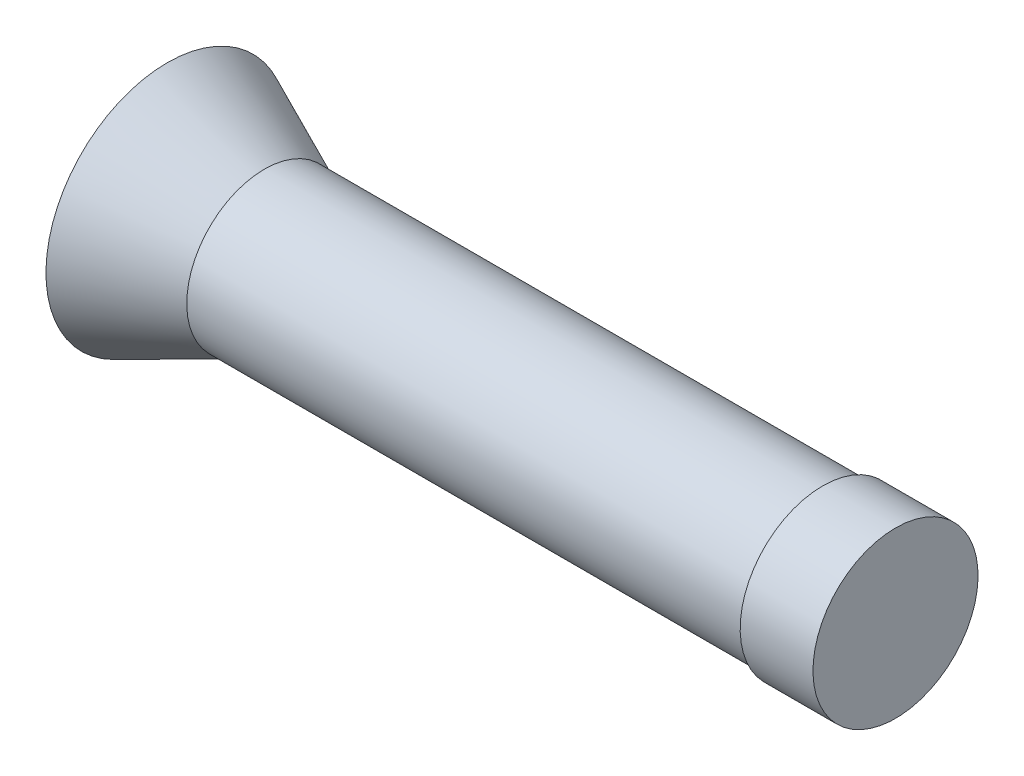
ISO-10303-21;
HEADER;
FILE_DESCRIPTION(('STEP AP214'),'2;1');
FILE_NAME('part.step','',(''),(''),'','','');
FILE_SCHEMA(('AUTOMOTIVE_DESIGN { 1 0 10303 214 1 1 1 1 }'));
ENDSEC;
DATA;
#1=APPLICATION_CONTEXT('core data for automotive mechanical design processes');
#2=APPLICATION_PROTOCOL_DEFINITION('international standard','automotive_design',2000,#1);
#3=PRODUCT_CONTEXT('',#1,'mechanical');
#4=PRODUCT('Part','Part','',(#3));
#5=PRODUCT_RELATED_PRODUCT_CATEGORY('part','',(#4));
#6=PRODUCT_DEFINITION_FORMATION('','',#4);
#7=PRODUCT_DEFINITION_CONTEXT('part definition',#1,'design');
#8=PRODUCT_DEFINITION('design','',#6,#7);
#9=PRODUCT_DEFINITION_SHAPE('','',#8);
#10=(LENGTH_UNIT() NAMED_UNIT(*) SI_UNIT(.MILLI.,.METRE.));
#11=(NAMED_UNIT(*) PLANE_ANGLE_UNIT() SI_UNIT($,.RADIAN.));
#12=(NAMED_UNIT(*) SI_UNIT($,.STERADIAN.) SOLID_ANGLE_UNIT());
#13=UNCERTAINTY_MEASURE_WITH_UNIT(LENGTH_MEASURE(1.E-05),#10,'distance_accuracy_value','');
#14=(GEOMETRIC_REPRESENTATION_CONTEXT(3) GLOBAL_UNCERTAINTY_ASSIGNED_CONTEXT((#13)) GLOBAL_UNIT_ASSIGNED_CONTEXT((#10,
#11,#12)) REPRESENTATION_CONTEXT('',''));
#15=CARTESIAN_POINT('',(0.,0.,0.));
#16=DIRECTION('',(0.,0.,1.));
#17=DIRECTION('',(1.,0.,0.));
#18=AXIS2_PLACEMENT_3D('',#15,#16,#17);
#19=CARTESIAN_POINT('',(0.,0.,0.));
#20=DIRECTION('',(-1.,0.,0.));
#21=DIRECTION('',(0.,-1.,0.));
#22=AXIS2_PLACEMENT_3D('',#19,#20,#21);
#23=PLANE('',#22);
#24=CARTESIAN_POINT('',(0.,-16.,0.));
#25=DIRECTION('',(1.,0.,0.));
#26=DIRECTION('',(0.,1.,0.));
#27=AXIS2_PLACEMENT_3D('',#24,#25,#26);
#28=CIRCLE('',#27,16.);
#29=CARTESIAN_POINT('',(0.,0.,0.));
#30=VERTEX_POINT('',#29);
#31=EDGE_CURVE('E51',#30,#30,#28,.T.);
#32=ORIENTED_EDGE('',*,*,#31,.T.);
#33=EDGE_LOOP('',(#32));
#34=FACE_BOUND('',#33,.T.);
#35=CARTESIAN_POINT('',(0.,-16.,0.));
#36=DIRECTION('',(1.,0.,0.));
#37=DIRECTION('',(0.,1.,0.));
#38=AXIS2_PLACEMENT_3D('',#35,#36,#37);
#39=CIRCLE('',#38,17.);
#40=CARTESIAN_POINT('',(0.,1.,0.));
#41=VERTEX_POINT('',#40);
#42=EDGE_CURVE('E10',#41,#41,#39,.T.);
#43=ORIENTED_EDGE('',*,*,#42,.F.);
#44=EDGE_LOOP('',(#43));
#45=FACE_BOUND('',#44,.T.);
#46=ADVANCED_FACE('F32',(#34,#45),#23,.T.);
#47=CARTESIAN_POINT('',(15.,-16.,0.));
#48=DIRECTION('',(1.,0.,0.));
#49=DIRECTION('',(0.,1.,0.));
#50=AXIS2_PLACEMENT_3D('',#47,#48,#49);
#51=CYLINDRICAL_SURFACE('',#50,17.);
#52=ORIENTED_EDGE('',*,*,#42,.T.);
#53=EDGE_LOOP('',(#52));
#54=FACE_BOUND('',#53,.T.);
#55=CARTESIAN_POINT('',(15.,-16.,0.));
#56=DIRECTION('',(1.,0.,0.));
#57=DIRECTION('',(0.,1.,0.));
#58=AXIS2_PLACEMENT_3D('',#55,#56,#57);
#59=CIRCLE('',#58,17.);
#60=CARTESIAN_POINT('',(15.,1.,0.));
#61=VERTEX_POINT('',#60);
#62=EDGE_CURVE('E38',#61,#61,#59,.T.);
#63=ORIENTED_EDGE('',*,*,#62,.F.);
#64=EDGE_LOOP('',(#63));
#65=FACE_BOUND('',#64,.T.);
#66=ADVANCED_FACE('F90',(#54,#65),#51,.T.);
#67=CARTESIAN_POINT('',(15.,1.,0.));
#68=DIRECTION('',(1.,0.,0.));
#69=DIRECTION('',(0.,1.,0.));
#70=AXIS2_PLACEMENT_3D('',#67,#68,#69);
#71=PLANE('',#70);
#72=ORIENTED_EDGE('',*,*,#62,.T.);
#73=EDGE_LOOP('',(#72));
#74=FACE_BOUND('',#73,.T.);
#75=ADVANCED_FACE('F74',(#74),#71,.T.);
#76=CARTESIAN_POINT('',(-135.,-16.,0.));
#77=DIRECTION('',(-1.,0.,0.));
#78=DIRECTION('',(0.,-1.,0.));
#79=AXIS2_PLACEMENT_3D('',#76,#77,#78);
#80=PLANE('',#79);
#81=CARTESIAN_POINT('',(-135.,-16.,0.));
#82=DIRECTION('',(-1.,0.,0.));
#83=DIRECTION('',(0.,-1.,0.));
#84=AXIS2_PLACEMENT_3D('',#81,#82,#83);
#85=CIRCLE('',#84,15.);
#86=CARTESIAN_POINT('',(-135.,-31.,0.));
#87=VERTEX_POINT('',#86);
#88=EDGE_CURVE('E55',#87,#87,#85,.T.);
#89=ORIENTED_EDGE('',*,*,#88,.F.);
#90=EDGE_LOOP('',(#89));
#91=FACE_BOUND('',#90,.T.);
#92=CARTESIAN_POINT('',(-135.,-16.,0.));
#93=DIRECTION('',(1.,0.,0.));
#94=DIRECTION('',(0.,1.,0.));
#95=AXIS2_PLACEMENT_3D('',#92,#93,#94);
#96=CIRCLE('',#95,25.);
#97=CARTESIAN_POINT('',(-135.,8.99999999999998,0.));
#98=VERTEX_POINT('',#97);
#99=EDGE_CURVE('E42',#98,#98,#96,.T.);
#100=ORIENTED_EDGE('',*,*,#99,.F.);
#101=EDGE_LOOP('',(#100));
#102=FACE_BOUND('',#101,.T.);
#103=ADVANCED_FACE('F70',(#91,#102),#80,.T.);
#104=CARTESIAN_POINT('',(-115.,-16.,0.));
#105=DIRECTION('',(-1.,0.,0.));
#106=DIRECTION('',(0.,-1.,0.));
#107=AXIS2_PLACEMENT_3D('',#104,#105,#106);
#108=CONICAL_SURFACE('',#107,16.,0.422853926132941);
#109=ORIENTED_EDGE('',*,*,#99,.T.);
#110=EDGE_LOOP('',(#109));
#111=FACE_BOUND('',#110,.T.);
#112=CARTESIAN_POINT('',(-115.,-16.,0.));
#113=DIRECTION('',(1.,0.,0.));
#114=DIRECTION('',(0.,1.,0.));
#115=AXIS2_PLACEMENT_3D('',#112,#113,#114);
#116=CIRCLE('',#115,16.);
#117=CARTESIAN_POINT('',(-115.,0.,0.));
#118=VERTEX_POINT('',#117);
#119=EDGE_CURVE('E46',#118,#118,#116,.T.);
#120=ORIENTED_EDGE('',*,*,#119,.F.);
#121=EDGE_LOOP('',(#120));
#122=FACE_BOUND('',#121,.T.);
#123=ADVANCED_FACE('F73',(#111,#122),#108,.T.);
#124=CARTESIAN_POINT('',(15.,-16.,0.));
#125=DIRECTION('',(1.,0.,0.));
#126=DIRECTION('',(0.,1.,0.));
#127=AXIS2_PLACEMENT_3D('',#124,#125,#126);
#128=CYLINDRICAL_SURFACE('',#127,16.);
#129=ORIENTED_EDGE('',*,*,#119,.T.);
#130=EDGE_LOOP('',(#129));
#131=FACE_BOUND('',#130,.T.);
#132=ORIENTED_EDGE('',*,*,#31,.F.);
#133=EDGE_LOOP('',(#132));
#134=FACE_BOUND('',#133,.T.);
#135=ADVANCED_FACE('F66',(#131,#134),#128,.T.);
#136=CARTESIAN_POINT('',(10.,-16.,0.));
#137=DIRECTION('',(-1.,0.,0.));
#138=DIRECTION('',(0.,-1.,0.));
#139=AXIS2_PLACEMENT_3D('',#136,#137,#138);
#140=CYLINDRICAL_SURFACE('',#139,15.);
#141=CARTESIAN_POINT('',(10.,-16.,0.));
#142=DIRECTION('',(-1.,0.,0.));
#143=DIRECTION('',(0.,-1.,0.));
#144=AXIS2_PLACEMENT_3D('',#141,#142,#143);
#145=CIRCLE('',#144,15.);
#146=CARTESIAN_POINT('',(10.,-31.,0.));
#147=VERTEX_POINT('',#146);
#148=EDGE_CURVE('E54',#147,#147,#145,.T.);
#149=ORIENTED_EDGE('',*,*,#148,.F.);
#150=EDGE_LOOP('',(#149));
#151=FACE_BOUND('',#150,.T.);
#152=ORIENTED_EDGE('',*,*,#88,.T.);
#153=EDGE_LOOP('',(#152));
#154=FACE_BOUND('',#153,.T.);
#155=ADVANCED_FACE('F63',(#151,#154),#140,.F.);
#156=CARTESIAN_POINT('',(10.,-16.,0.));
#157=DIRECTION('',(-1.,0.,0.));
#158=DIRECTION('',(0.,-1.,0.));
#159=AXIS2_PLACEMENT_3D('',#156,#157,#158);
#160=PLANE('',#159);
#161=ORIENTED_EDGE('',*,*,#148,.T.);
#162=EDGE_LOOP('',(#161));
#163=FACE_BOUND('',#162,.T.);
#164=ADVANCED_FACE('F61',(#163),#160,.T.);
#165=CLOSED_SHELL('',(#46,#66,#75,#103,#123,#135,#155,#164));
#166=MANIFOLD_SOLID_BREP('B2',#165);
#167=ADVANCED_BREP_SHAPE_REPRESENTATION('',(#18,#166),#14);
#168=SHAPE_DEFINITION_REPRESENTATION(#9,#167);
ENDSEC;
END-ISO-10303-21;
